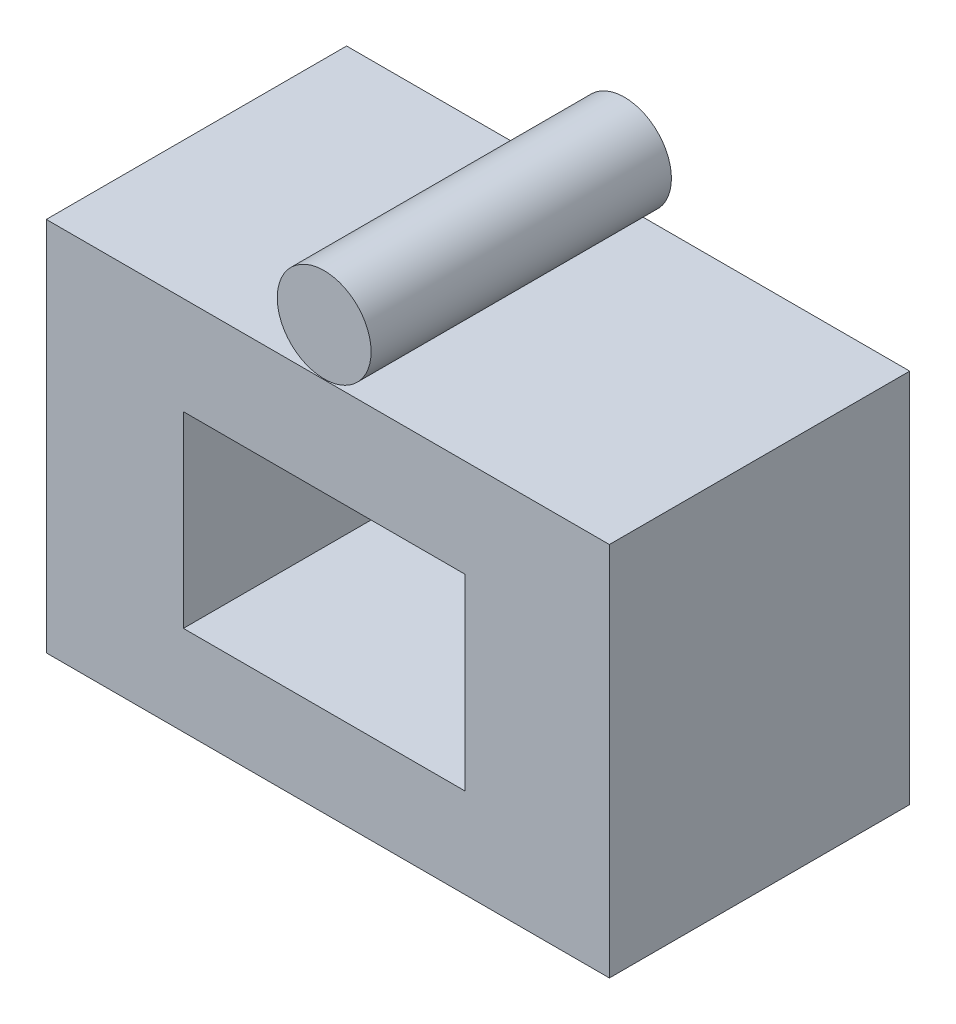
ISO-10303-21;
HEADER;
FILE_DESCRIPTION(('STEP AP214'),'2;1');
FILE_NAME('part.step','',(''),(''),'','','');
FILE_SCHEMA(('AUTOMOTIVE_DESIGN { 1 0 10303 214 1 1 1 1 }'));
ENDSEC;
DATA;
#1=APPLICATION_CONTEXT('core data for automotive mechanical design processes');
#2=APPLICATION_PROTOCOL_DEFINITION('international standard','automotive_design',2000,#1);
#3=PRODUCT_CONTEXT('',#1,'mechanical');
#4=PRODUCT('Part','Part','',(#3));
#5=PRODUCT_RELATED_PRODUCT_CATEGORY('part','',(#4));
#6=PRODUCT_DEFINITION_FORMATION('','',#4);
#7=PRODUCT_DEFINITION_CONTEXT('part definition',#1,'design');
#8=PRODUCT_DEFINITION('design','',#6,#7);
#9=PRODUCT_DEFINITION_SHAPE('','',#8);
#10=(LENGTH_UNIT() NAMED_UNIT(*) SI_UNIT(.MILLI.,.METRE.));
#11=(NAMED_UNIT(*) PLANE_ANGLE_UNIT() SI_UNIT($,.RADIAN.));
#12=(NAMED_UNIT(*) SI_UNIT($,.STERADIAN.) SOLID_ANGLE_UNIT());
#13=UNCERTAINTY_MEASURE_WITH_UNIT(LENGTH_MEASURE(1.E-05),#10,'distance_accuracy_value','');
#14=(GEOMETRIC_REPRESENTATION_CONTEXT(3) GLOBAL_UNCERTAINTY_ASSIGNED_CONTEXT((#13)) GLOBAL_UNIT_ASSIGNED_CONTEXT((#10,
#11,#12)) REPRESENTATION_CONTEXT('',''));
#15=CARTESIAN_POINT('',(0.,0.,0.));
#16=DIRECTION('',(0.,0.,1.));
#17=DIRECTION('',(1.,0.,0.));
#18=AXIS2_PLACEMENT_3D('',#15,#16,#17);
#19=CARTESIAN_POINT('',(11.6304347826087,53.6818232654625,0.));
#20=DIRECTION('',(0.,0.,1.));
#21=DIRECTION('',(1.,0.,0.));
#22=AXIS2_PLACEMENT_3D('',#19,#20,#21);
#23=CYLINDRICAL_SURFACE('',#22,12.5);
#24=CARTESIAN_POINT('',(11.6304347826087,53.6818232654625,0.));
#25=DIRECTION('',(0.,0.,1.));
#26=DIRECTION('',(1.,0.,0.));
#27=AXIS2_PLACEMENT_3D('',#24,#25,#26);
#28=CIRCLE('',#27,12.5);
#29=CARTESIAN_POINT('',(24.1304347826087,53.6818232654625,0.));
#30=VERTEX_POINT('',#29);
#31=EDGE_CURVE('E11',#30,#30,#28,.T.);
#32=ORIENTED_EDGE('',*,*,#31,.T.);
#33=EDGE_LOOP('',(#32));
#34=FACE_BOUND('',#33,.T.);
#35=CARTESIAN_POINT('',(11.6304347826087,53.6818232654625,80.));
#36=DIRECTION('',(0.,0.,1.));
#37=DIRECTION('',(1.,0.,0.));
#38=AXIS2_PLACEMENT_3D('',#35,#36,#37);
#39=CIRCLE('',#38,12.5);
#40=CARTESIAN_POINT('',(24.1304347826087,53.6818232654625,80.));
#41=VERTEX_POINT('',#40);
#42=EDGE_CURVE('E44',#41,#41,#39,.T.);
#43=ORIENTED_EDGE('',*,*,#42,.F.);
#44=EDGE_LOOP('',(#43));
#45=FACE_BOUND('',#44,.T.);
#46=ADVANCED_FACE('F41',(#34,#45),#23,.T.);
#47=CARTESIAN_POINT('',(11.6304347826087,53.6818232654625,0.));
#48=DIRECTION('',(0.,0.,1.));
#49=DIRECTION('',(1.,0.,0.));
#50=AXIS2_PLACEMENT_3D('',#47,#48,#49);
#51=PLANE('',#50);
#52=ORIENTED_EDGE('',*,*,#31,.F.);
#53=EDGE_LOOP('',(#52));
#54=FACE_BOUND('',#53,.T.);
#55=ADVANCED_FACE('F56',(#54),#51,.F.);
#56=CARTESIAN_POINT('',(11.6304347826087,53.6818232654625,80.));
#57=DIRECTION('',(0.,0.,1.));
#58=DIRECTION('',(1.,0.,0.));
#59=AXIS2_PLACEMENT_3D('',#56,#57,#58);
#60=PLANE('',#59);
#61=ORIENTED_EDGE('',*,*,#42,.T.);
#62=EDGE_LOOP('',(#61));
#63=FACE_BOUND('',#62,.T.);
#64=ADVANCED_FACE('F53',(#63),#60,.T.);
#65=CLOSED_SHELL('',(#46,#55,#64));
#66=MANIFOLD_SOLID_BREP('B2',#65);
#67=CARTESIAN_POINT('',(0.,0.,80.));
#68=DIRECTION('',(0.,0.,1.));
#69=DIRECTION('',(1.,0.,0.));
#70=AXIS2_PLACEMENT_3D('',#67,#68,#69);
#71=PLANE('',#70);
#72=DIRECTION('',(0.,-1.,0.));
#73=VECTOR('',#72,1.);
#74=CARTESIAN_POINT('',(-62.3913043478261,40.9782608695652,80.));
#75=LINE('',#74,#73);
#76=CARTESIAN_POINT('',(-62.3913043478261,40.9782608695652,80.));
#77=VERTEX_POINT('',#76);
#78=CARTESIAN_POINT('',(-62.3913043478261,-59.0217391304348,80.));
#79=VERTEX_POINT('',#78);
#80=EDGE_CURVE('E182',#77,#79,#75,.T.);
#81=ORIENTED_EDGE('',*,*,#80,.T.);
#82=DIRECTION('',(1.,0.,0.));
#83=VECTOR('',#82,1.);
#84=CARTESIAN_POINT('',(-62.3913043478261,-59.0217391304348,80.));
#85=LINE('',#84,#83);
#86=CARTESIAN_POINT('',(87.6086956521739,-59.0217391304348,80.));
#87=VERTEX_POINT('',#86);
#88=EDGE_CURVE('E185',#79,#87,#85,.T.);
#89=ORIENTED_EDGE('',*,*,#88,.T.);
#90=DIRECTION('',(0.,1.,0.));
#91=VECTOR('',#90,1.);
#92=CARTESIAN_POINT('',(87.6086956521739,40.9782608695652,80.));
#93=LINE('',#92,#91);
#94=CARTESIAN_POINT('',(87.6086956521739,40.9782608695652,80.));
#95=VERTEX_POINT('',#94);
#96=EDGE_CURVE('E188',#87,#95,#93,.T.);
#97=ORIENTED_EDGE('',*,*,#96,.T.);
#98=DIRECTION('',(-1.,0.,0.));
#99=VECTOR('',#98,1.);
#100=CARTESIAN_POINT('',(-62.3913043478261,40.9782608695652,80.));
#101=LINE('',#100,#99);
#102=EDGE_CURVE('E190',#95,#77,#101,.T.);
#103=ORIENTED_EDGE('',*,*,#102,.T.);
#104=EDGE_LOOP('',(#81,#89,#97,#103));
#105=FACE_BOUND('',#104,.T.);
#106=DIRECTION('',(1.,0.,0.));
#107=VECTOR('',#106,1.);
#108=CARTESIAN_POINT('',(-25.8695652173913,-35.1086956521739,80.));
#109=LINE('',#108,#107);
#110=CARTESIAN_POINT('',(-25.8695652173913,-35.1086956521739,80.));
#111=VERTEX_POINT('',#110);
#112=CARTESIAN_POINT('',(49.1304347826087,-35.1086956521739,80.));
#113=VERTEX_POINT('',#112);
#114=EDGE_CURVE('E154',#111,#113,#109,.T.);
#115=ORIENTED_EDGE('',*,*,#114,.F.);
#116=DIRECTION('',(0.,-1.,0.));
#117=VECTOR('',#116,1.);
#118=CARTESIAN_POINT('',(-25.8695652173913,14.8913043478261,80.));
#119=LINE('',#118,#117);
#120=CARTESIAN_POINT('',(-25.8695652173913,14.8913043478261,80.));
#121=VERTEX_POINT('',#120);
#122=EDGE_CURVE('E146',#121,#111,#119,.T.);
#123=ORIENTED_EDGE('',*,*,#122,.F.);
#124=DIRECTION('',(-1.,0.,0.));
#125=VECTOR('',#124,1.);
#126=CARTESIAN_POINT('',(-25.8695652173913,14.8913043478261,80.));
#127=LINE('',#126,#125);
#128=CARTESIAN_POINT('',(49.1304347826087,14.8913043478261,80.));
#129=VERTEX_POINT('',#128);
#130=EDGE_CURVE('E168',#129,#121,#127,.T.);
#131=ORIENTED_EDGE('',*,*,#130,.F.);
#132=DIRECTION('',(0.,1.,0.));
#133=VECTOR('',#132,1.);
#134=CARTESIAN_POINT('',(49.1304347826087,14.8913043478261,80.));
#135=LINE('',#134,#133);
#136=EDGE_CURVE('E166',#113,#129,#135,.T.);
#137=ORIENTED_EDGE('',*,*,#136,.F.);
#138=EDGE_LOOP('',(#115,#123,#131,#137));
#139=FACE_BOUND('',#138,.T.);
#140=ADVANCED_FACE('F81',(#105,#139),#71,.T.);
#141=CARTESIAN_POINT('',(0.,0.,0.));
#142=DIRECTION('',(0.,0.,1.));
#143=DIRECTION('',(1.,0.,0.));
#144=AXIS2_PLACEMENT_3D('',#141,#142,#143);
#145=PLANE('',#144);
#146=DIRECTION('',(0.,-1.,0.));
#147=VECTOR('',#146,1.);
#148=CARTESIAN_POINT('',(-62.3913043478261,40.9782608695652,0.));
#149=LINE('',#148,#147);
#150=CARTESIAN_POINT('',(-62.3913043478261,40.9782608695652,0.));
#151=VERTEX_POINT('',#150);
#152=CARTESIAN_POINT('',(-62.3913043478261,-59.0217391304348,0.));
#153=VERTEX_POINT('',#152);
#154=EDGE_CURVE('E162',#151,#153,#149,.T.);
#155=ORIENTED_EDGE('',*,*,#154,.F.);
#156=DIRECTION('',(-1.,0.,0.));
#157=VECTOR('',#156,1.);
#158=CARTESIAN_POINT('',(-62.3913043478261,40.9782608695652,0.));
#159=LINE('',#158,#157);
#160=CARTESIAN_POINT('',(87.6086956521739,40.9782608695652,0.));
#161=VERTEX_POINT('',#160);
#162=EDGE_CURVE('E186',#161,#151,#159,.T.);
#163=ORIENTED_EDGE('',*,*,#162,.F.);
#164=DIRECTION('',(0.,1.,0.));
#165=VECTOR('',#164,1.);
#166=CARTESIAN_POINT('',(87.6086956521739,40.9782608695652,0.));
#167=LINE('',#166,#165);
#168=CARTESIAN_POINT('',(87.6086956521739,-59.0217391304348,0.));
#169=VERTEX_POINT('',#168);
#170=EDGE_CURVE('E197',#169,#161,#167,.T.);
#171=ORIENTED_EDGE('',*,*,#170,.F.);
#172=DIRECTION('',(1.,0.,0.));
#173=VECTOR('',#172,1.);
#174=CARTESIAN_POINT('',(-62.3913043478261,-59.0217391304348,0.));
#175=LINE('',#174,#173);
#176=EDGE_CURVE('E195',#153,#169,#175,.T.);
#177=ORIENTED_EDGE('',*,*,#176,.F.);
#178=EDGE_LOOP('',(#155,#163,#171,#177));
#179=FACE_BOUND('',#178,.T.);
#180=DIRECTION('',(0.,-1.,0.));
#181=VECTOR('',#180,1.);
#182=CARTESIAN_POINT('',(-25.8695652173913,14.8913043478261,0.));
#183=LINE('',#182,#181);
#184=CARTESIAN_POINT('',(-25.8695652173913,14.8913043478261,0.));
#185=VERTEX_POINT('',#184);
#186=CARTESIAN_POINT('',(-25.8695652173913,-35.1086956521739,0.));
#187=VERTEX_POINT('',#186);
#188=EDGE_CURVE('E104',#185,#187,#183,.T.);
#189=ORIENTED_EDGE('',*,*,#188,.T.);
#190=DIRECTION('',(1.,0.,0.));
#191=VECTOR('',#190,1.);
#192=CARTESIAN_POINT('',(-25.8695652173913,-35.1086956521739,0.));
#193=LINE('',#192,#191);
#194=CARTESIAN_POINT('',(49.1304347826087,-35.1086956521739,0.));
#195=VERTEX_POINT('',#194);
#196=EDGE_CURVE('E161',#187,#195,#193,.T.);
#197=ORIENTED_EDGE('',*,*,#196,.T.);
#198=DIRECTION('',(0.,1.,0.));
#199=VECTOR('',#198,1.);
#200=CARTESIAN_POINT('',(49.1304347826087,14.8913043478261,0.));
#201=LINE('',#200,#199);
#202=CARTESIAN_POINT('',(49.1304347826087,14.8913043478261,0.));
#203=VERTEX_POINT('',#202);
#204=EDGE_CURVE('E174',#195,#203,#201,.T.);
#205=ORIENTED_EDGE('',*,*,#204,.T.);
#206=DIRECTION('',(-1.,0.,0.));
#207=VECTOR('',#206,1.);
#208=CARTESIAN_POINT('',(-25.8695652173913,14.8913043478261,0.));
#209=LINE('',#208,#207);
#210=EDGE_CURVE('E155',#203,#185,#209,.T.);
#211=ORIENTED_EDGE('',*,*,#210,.T.);
#212=EDGE_LOOP('',(#189,#197,#205,#211));
#213=FACE_BOUND('',#212,.T.);
#214=ADVANCED_FACE('F215',(#179,#213),#145,.F.);
#215=CARTESIAN_POINT('',(-62.3913043478261,40.9782608695652,80.));
#216=DIRECTION('',(1.,0.,0.));
#217=DIRECTION('',(0.,0.,-1.));
#218=AXIS2_PLACEMENT_3D('',#215,#216,#217);
#219=PLANE('',#218);
#220=ORIENTED_EDGE('',*,*,#154,.T.);
#221=DIRECTION('',(0.,0.,-1.));
#222=VECTOR('',#221,1.);
#223=CARTESIAN_POINT('',(-62.3913043478261,-59.0217391304348,80.));
#224=LINE('',#223,#222);
#225=EDGE_CURVE('E39',#79,#153,#224,.T.);
#226=ORIENTED_EDGE('',*,*,#225,.F.);
#227=ORIENTED_EDGE('',*,*,#80,.F.);
#228=DIRECTION('',(0.,0.,-1.));
#229=VECTOR('',#228,1.);
#230=CARTESIAN_POINT('',(-62.3913043478261,40.9782608695652,80.));
#231=LINE('',#230,#229);
#232=EDGE_CURVE('E192',#77,#151,#231,.T.);
#233=ORIENTED_EDGE('',*,*,#232,.T.);
#234=EDGE_LOOP('',(#220,#226,#227,#233));
#235=FACE_BOUND('',#234,.T.);
#236=ADVANCED_FACE('F83',(#235),#219,.F.);
#237=CARTESIAN_POINT('',(-62.3913043478261,-59.0217391304348,80.));
#238=DIRECTION('',(0.,1.,0.));
#239=DIRECTION('',(-1.,0.,0.));
#240=AXIS2_PLACEMENT_3D('',#237,#238,#239);
#241=PLANE('',#240);
#242=ORIENTED_EDGE('',*,*,#176,.T.);
#243=DIRECTION('',(0.,0.,-1.));
#244=VECTOR('',#243,1.);
#245=CARTESIAN_POINT('',(87.6086956521739,-59.0217391304348,80.));
#246=LINE('',#245,#244);
#247=EDGE_CURVE('E89',#87,#169,#246,.T.);
#248=ORIENTED_EDGE('',*,*,#247,.F.);
#249=ORIENTED_EDGE('',*,*,#88,.F.);
#250=ORIENTED_EDGE('',*,*,#225,.T.);
#251=EDGE_LOOP('',(#242,#248,#249,#250));
#252=FACE_BOUND('',#251,.T.);
#253=ADVANCED_FACE('F225',(#252),#241,.F.);
#254=CARTESIAN_POINT('',(87.6086956521739,40.9782608695652,80.));
#255=DIRECTION('',(-1.,0.,0.));
#256=DIRECTION('',(0.,0.,1.));
#257=AXIS2_PLACEMENT_3D('',#254,#255,#256);
#258=PLANE('',#257);
#259=ORIENTED_EDGE('',*,*,#170,.T.);
#260=DIRECTION('',(0.,0.,-1.));
#261=VECTOR('',#260,1.);
#262=CARTESIAN_POINT('',(87.6086956521739,40.9782608695652,80.));
#263=LINE('',#262,#261);
#264=EDGE_CURVE('E202',#95,#161,#263,.T.);
#265=ORIENTED_EDGE('',*,*,#264,.F.);
#266=ORIENTED_EDGE('',*,*,#96,.F.);
#267=ORIENTED_EDGE('',*,*,#247,.T.);
#268=EDGE_LOOP('',(#259,#265,#266,#267));
#269=FACE_BOUND('',#268,.T.);
#270=ADVANCED_FACE('F209',(#269),#258,.F.);
#271=CARTESIAN_POINT('',(-62.3913043478261,40.9782608695652,80.));
#272=DIRECTION('',(0.,-1.,0.));
#273=DIRECTION('',(0.,0.,-1.));
#274=AXIS2_PLACEMENT_3D('',#271,#272,#273);
#275=PLANE('',#274);
#276=ORIENTED_EDGE('',*,*,#162,.T.);
#277=ORIENTED_EDGE('',*,*,#232,.F.);
#278=ORIENTED_EDGE('',*,*,#102,.F.);
#279=ORIENTED_EDGE('',*,*,#264,.T.);
#280=EDGE_LOOP('',(#276,#277,#278,#279));
#281=FACE_BOUND('',#280,.T.);
#282=ADVANCED_FACE('F219',(#281),#275,.F.);
#283=CARTESIAN_POINT('',(-25.8695652173913,14.8913043478261,80.));
#284=DIRECTION('',(1.,0.,0.));
#285=DIRECTION('',(0.,1.,0.));
#286=AXIS2_PLACEMENT_3D('',#283,#284,#285);
#287=PLANE('',#286);
#288=ORIENTED_EDGE('',*,*,#188,.F.);
#289=DIRECTION('',(0.,0.,-1.));
#290=VECTOR('',#289,1.);
#291=CARTESIAN_POINT('',(-25.8695652173913,14.8913043478261,80.));
#292=LINE('',#291,#290);
#293=EDGE_CURVE('E150',#121,#185,#292,.T.);
#294=ORIENTED_EDGE('',*,*,#293,.F.);
#295=ORIENTED_EDGE('',*,*,#122,.T.);
#296=DIRECTION('',(0.,0.,-1.));
#297=VECTOR('',#296,1.);
#298=CARTESIAN_POINT('',(-25.8695652173913,-35.1086956521739,80.));
#299=LINE('',#298,#297);
#300=EDGE_CURVE('E149',#111,#187,#299,.T.);
#301=ORIENTED_EDGE('',*,*,#300,.T.);
#302=EDGE_LOOP('',(#288,#294,#295,#301));
#303=FACE_BOUND('',#302,.T.);
#304=ADVANCED_FACE('F148',(#303),#287,.T.);
#305=CARTESIAN_POINT('',(-25.8695652173913,-35.1086956521739,80.));
#306=DIRECTION('',(0.,1.,0.));
#307=DIRECTION('',(0.,0.,1.));
#308=AXIS2_PLACEMENT_3D('',#305,#306,#307);
#309=PLANE('',#308);
#310=ORIENTED_EDGE('',*,*,#196,.F.);
#311=ORIENTED_EDGE('',*,*,#300,.F.);
#312=ORIENTED_EDGE('',*,*,#114,.T.);
#313=DIRECTION('',(0.,0.,-1.));
#314=VECTOR('',#313,1.);
#315=CARTESIAN_POINT('',(49.1304347826087,-35.1086956521739,80.));
#316=LINE('',#315,#314);
#317=EDGE_CURVE('E163',#113,#195,#316,.T.);
#318=ORIENTED_EDGE('',*,*,#317,.T.);
#319=EDGE_LOOP('',(#310,#311,#312,#318));
#320=FACE_BOUND('',#319,.T.);
#321=ADVANCED_FACE('F158',(#320),#309,.T.);
#322=CARTESIAN_POINT('',(49.1304347826087,14.8913043478261,80.));
#323=DIRECTION('',(-1.,0.,0.));
#324=DIRECTION('',(0.,-1.,0.));
#325=AXIS2_PLACEMENT_3D('',#322,#323,#324);
#326=PLANE('',#325);
#327=ORIENTED_EDGE('',*,*,#204,.F.);
#328=ORIENTED_EDGE('',*,*,#317,.F.);
#329=ORIENTED_EDGE('',*,*,#136,.T.);
#330=DIRECTION('',(0.,0.,-1.));
#331=VECTOR('',#330,1.);
#332=CARTESIAN_POINT('',(49.1304347826087,14.8913043478261,80.));
#333=LINE('',#332,#331);
#334=EDGE_CURVE('E96',#129,#203,#333,.T.);
#335=ORIENTED_EDGE('',*,*,#334,.T.);
#336=EDGE_LOOP('',(#327,#328,#329,#335));
#337=FACE_BOUND('',#336,.T.);
#338=ADVANCED_FACE('F248',(#337),#326,.T.);
#339=CARTESIAN_POINT('',(-25.8695652173913,14.8913043478261,80.));
#340=DIRECTION('',(0.,-1.,0.));
#341=DIRECTION('',(0.,0.,-1.));
#342=AXIS2_PLACEMENT_3D('',#339,#340,#341);
#343=PLANE('',#342);
#344=ORIENTED_EDGE('',*,*,#210,.F.);
#345=ORIENTED_EDGE('',*,*,#334,.F.);
#346=ORIENTED_EDGE('',*,*,#130,.T.);
#347=ORIENTED_EDGE('',*,*,#293,.T.);
#348=EDGE_LOOP('',(#344,#345,#346,#347));
#349=FACE_BOUND('',#348,.T.);
#350=ADVANCED_FACE('F252',(#349),#343,.T.);
#351=CLOSED_SHELL('',(#140,#214,#236,#253,#270,#282,#304,#321,#338,#350));
#352=MANIFOLD_SOLID_BREP('B6',#351);
#353=ADVANCED_BREP_SHAPE_REPRESENTATION('',(#18,#66,#352),#14);
#354=SHAPE_DEFINITION_REPRESENTATION(#9,#353);
ENDSEC;
END-ISO-10303-21;
